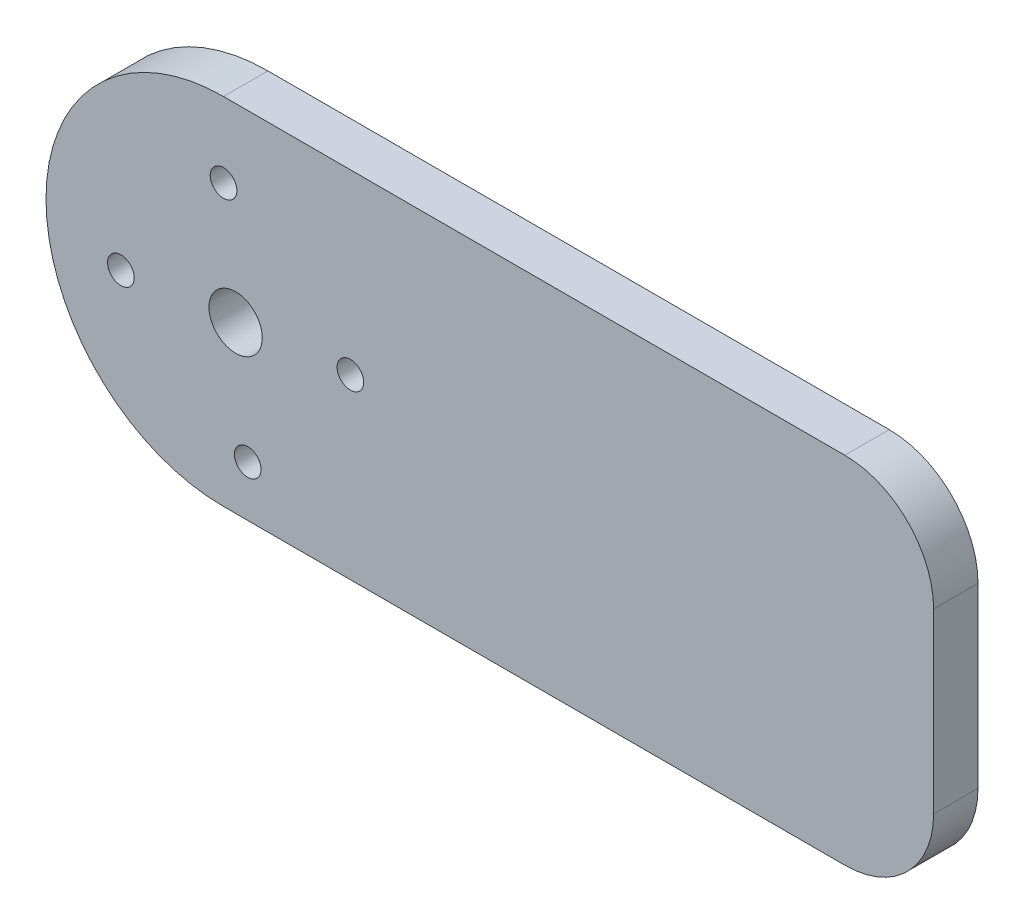
ISO-10303-21;
HEADER;
FILE_DESCRIPTION(('STEP AP214'),'2;1');
FILE_NAME('part.step','',(''),(''),'','','');
FILE_SCHEMA(('AUTOMOTIVE_DESIGN { 1 0 10303 214 1 1 1 1 }'));
ENDSEC;
DATA;
#1=APPLICATION_CONTEXT('core data for automotive mechanical design processes');
#2=APPLICATION_PROTOCOL_DEFINITION('international standard','automotive_design',2000,#1);
#3=PRODUCT_CONTEXT('',#1,'mechanical');
#4=PRODUCT('Part','Part','',(#3));
#5=PRODUCT_RELATED_PRODUCT_CATEGORY('part','',(#4));
#6=PRODUCT_DEFINITION_FORMATION('','',#4);
#7=PRODUCT_DEFINITION_CONTEXT('part definition',#1,'design');
#8=PRODUCT_DEFINITION('design','',#6,#7);
#9=PRODUCT_DEFINITION_SHAPE('','',#8);
#10=(LENGTH_UNIT() NAMED_UNIT(*) SI_UNIT(.MILLI.,.METRE.));
#11=(NAMED_UNIT(*) PLANE_ANGLE_UNIT() SI_UNIT($,.RADIAN.));
#12=(NAMED_UNIT(*) SI_UNIT($,.STERADIAN.) SOLID_ANGLE_UNIT());
#13=UNCERTAINTY_MEASURE_WITH_UNIT(LENGTH_MEASURE(1.E-05),#10,'distance_accuracy_value','');
#14=(GEOMETRIC_REPRESENTATION_CONTEXT(3) GLOBAL_UNCERTAINTY_ASSIGNED_CONTEXT((#13)) GLOBAL_UNIT_ASSIGNED_CONTEXT((#10,
#11,#12)) REPRESENTATION_CONTEXT('',''));
#15=CARTESIAN_POINT('',(0.,0.,0.));
#16=DIRECTION('',(0.,0.,1.));
#17=DIRECTION('',(1.,0.,0.));
#18=AXIS2_PLACEMENT_3D('',#15,#16,#17);
#19=CARTESIAN_POINT('',(0.,0.,5.));
#20=DIRECTION('',(0.,0.,1.));
#21=DIRECTION('',(1.,0.,0.));
#22=AXIS2_PLACEMENT_3D('',#19,#20,#21);
#23=PLANE('',#22);
#24=CARTESIAN_POINT('',(1.36380593722712,-1.36380593722729,5.));
#25=DIRECTION('',(0.,0.,1.));
#26=DIRECTION('',(1.,0.,0.));
#27=AXIS2_PLACEMENT_3D('',#24,#25,#26);
#28=CIRCLE('',#27,3.);
#29=CARTESIAN_POINT('',(4.36380593722713,-1.36380593722729,5.));
#30=VERTEX_POINT('',#29);
#31=EDGE_CURVE('E264',#30,#30,#28,.T.);
#32=ORIENTED_EDGE('',*,*,#31,.F.);
#33=EDGE_LOOP('',(#32));
#34=FACE_BOUND('',#33,.T.);
#35=CARTESIAN_POINT('',(2.72761187445429,-14.2920708388133,5.));
#36=DIRECTION('',(0.,0.,1.));
#37=DIRECTION('',(1.,0.,0.));
#38=AXIS2_PLACEMENT_3D('',#35,#36,#37);
#39=CIRCLE('',#38,1.5);
#40=CARTESIAN_POINT('',(4.22761187445429,-14.2920708388133,5.));
#41=VERTEX_POINT('',#40);
#42=EDGE_CURVE('E278',#41,#41,#39,.T.);
#43=ORIENTED_EDGE('',*,*,#42,.F.);
#44=EDGE_LOOP('',(#43));
#45=FACE_BOUND('',#44,.T.);
#46=CARTESIAN_POINT('',(0.,11.564458964359,5.));
#47=DIRECTION('',(0.,0.,1.));
#48=DIRECTION('',(1.,0.,0.));
#49=AXIS2_PLACEMENT_3D('',#46,#47,#48);
#50=CIRCLE('',#49,1.5);
#51=CARTESIAN_POINT('',(1.5,11.564458964359,5.));
#52=VERTEX_POINT('',#51);
#53=EDGE_CURVE('E138',#52,#52,#50,.T.);
#54=ORIENTED_EDGE('',*,*,#53,.F.);
#55=EDGE_LOOP('',(#54));
#56=FACE_BOUND('',#55,.T.);
#57=DIRECTION('',(1.,0.,0.));
#58=VECTOR('',#57,1.);
#59=CARTESIAN_POINT('',(0.,-20.,5.));
#60=LINE('',#59,#58);
#61=CARTESIAN_POINT('',(0.,-20.,5.));
#62=VERTEX_POINT('',#61);
#63=CARTESIAN_POINT('',(70.,-20.,5.));
#64=VERTEX_POINT('',#63);
#65=EDGE_CURVE('E85',#62,#64,#60,.T.);
#66=ORIENTED_EDGE('',*,*,#65,.T.);
#67=CARTESIAN_POINT('',(70.,-10.,5.));
#68=DIRECTION('',(0.,0.,1.));
#69=DIRECTION('',(1.,0.,0.));
#70=AXIS2_PLACEMENT_3D('',#67,#68,#69);
#71=CIRCLE('',#70,10.);
#72=CARTESIAN_POINT('',(80.,-10.,5.));
#73=VERTEX_POINT('',#72);
#74=EDGE_CURVE('E40',#64,#73,#71,.T.);
#75=ORIENTED_EDGE('',*,*,#74,.T.);
#76=DIRECTION('',(0.,1.,0.));
#77=VECTOR('',#76,1.);
#78=CARTESIAN_POINT('',(80.,20.,5.));
#79=LINE('',#78,#77);
#80=CARTESIAN_POINT('',(80.,10.,5.));
#81=VERTEX_POINT('',#80);
#82=EDGE_CURVE('E92',#73,#81,#79,.T.);
#83=ORIENTED_EDGE('',*,*,#82,.T.);
#84=CARTESIAN_POINT('',(70.,10.,5.));
#85=DIRECTION('',(0.,0.,1.));
#86=DIRECTION('',(1.,0.,0.));
#87=AXIS2_PLACEMENT_3D('',#84,#85,#86);
#88=CIRCLE('',#87,10.);
#89=CARTESIAN_POINT('',(70.,20.,5.));
#90=VERTEX_POINT('',#89);
#91=EDGE_CURVE('E47',#81,#90,#88,.T.);
#92=ORIENTED_EDGE('',*,*,#91,.T.);
#93=DIRECTION('',(-1.,0.,0.));
#94=VECTOR('',#93,1.);
#95=CARTESIAN_POINT('',(0.,20.,5.));
#96=LINE('',#95,#94);
#97=CARTESIAN_POINT('',(0.,20.,5.));
#98=VERTEX_POINT('',#97);
#99=EDGE_CURVE('E97',#90,#98,#96,.T.);
#100=ORIENTED_EDGE('',*,*,#99,.T.);
#101=CARTESIAN_POINT('',(0.,0.,5.));
#102=DIRECTION('',(0.,0.,1.));
#103=DIRECTION('',(1.,0.,0.));
#104=AXIS2_PLACEMENT_3D('',#101,#102,#103);
#105=CIRCLE('',#104,20.);
#106=EDGE_CURVE('E93',#98,#62,#105,.T.);
#107=ORIENTED_EDGE('',*,*,#106,.T.);
#108=EDGE_LOOP('',(#66,#75,#83,#92,#100,#107));
#109=FACE_BOUND('',#108,.T.);
#110=CARTESIAN_POINT('',(14.2920708388133,0.,5.));
#111=DIRECTION('',(0.,0.,1.));
#112=DIRECTION('',(1.,0.,0.));
#113=AXIS2_PLACEMENT_3D('',#110,#111,#112);
#114=CIRCLE('',#113,1.5);
#115=CARTESIAN_POINT('',(15.7920708388133,0.,5.));
#116=VERTEX_POINT('',#115);
#117=EDGE_CURVE('E284',#116,#116,#114,.T.);
#118=ORIENTED_EDGE('',*,*,#117,.F.);
#119=EDGE_LOOP('',(#118));
#120=FACE_BOUND('',#119,.T.);
#121=CARTESIAN_POINT('',(-11.564458964359,-2.72761187445428,5.));
#122=DIRECTION('',(0.,0.,1.));
#123=DIRECTION('',(1.,0.,0.));
#124=AXIS2_PLACEMENT_3D('',#121,#122,#123);
#125=CIRCLE('',#124,1.5);
#126=CARTESIAN_POINT('',(-10.064458964359,-2.72761187445428,5.));
#127=VERTEX_POINT('',#126);
#128=EDGE_CURVE('E272',#127,#127,#125,.T.);
#129=ORIENTED_EDGE('',*,*,#128,.F.);
#130=EDGE_LOOP('',(#129));
#131=FACE_BOUND('',#130,.T.);
#132=ADVANCED_FACE('F32',(#34,#45,#56,#109,#120,#131),#23,.T.);
#133=CARTESIAN_POINT('',(0.,0.,0.));
#134=DIRECTION('',(0.,0.,1.));
#135=DIRECTION('',(1.,0.,0.));
#136=AXIS2_PLACEMENT_3D('',#133,#134,#135);
#137=PLANE('',#136);
#138=CARTESIAN_POINT('',(1.36380593722712,-1.36380593722729,0.));
#139=DIRECTION('',(0.,0.,-1.));
#140=DIRECTION('',(-1.,0.,0.));
#141=AXIS2_PLACEMENT_3D('',#138,#139,#140);
#142=CIRCLE('',#141,3.);
#143=CARTESIAN_POINT('',(-1.63619406277288,-1.36380593722729,0.));
#144=VERTEX_POINT('',#143);
#145=EDGE_CURVE('E267',#144,#144,#142,.T.);
#146=ORIENTED_EDGE('',*,*,#145,.F.);
#147=EDGE_LOOP('',(#146));
#148=FACE_BOUND('',#147,.T.);
#149=DIRECTION('',(0.,1.,0.));
#150=VECTOR('',#149,1.);
#151=CARTESIAN_POINT('',(80.,20.,0.));
#152=LINE('',#151,#150);
#153=CARTESIAN_POINT('',(80.,-10.,0.));
#154=VERTEX_POINT('',#153);
#155=CARTESIAN_POINT('',(80.,10.,0.));
#156=VERTEX_POINT('',#155);
#157=EDGE_CURVE('E135',#154,#156,#152,.T.);
#158=ORIENTED_EDGE('',*,*,#157,.F.);
#159=CARTESIAN_POINT('',(70.,-10.,0.));
#160=DIRECTION('',(0.,0.,1.));
#161=DIRECTION('',(1.,0.,0.));
#162=AXIS2_PLACEMENT_3D('',#159,#160,#161);
#163=CIRCLE('',#162,10.);
#164=CARTESIAN_POINT('',(70.,-20.,0.));
#165=VERTEX_POINT('',#164);
#166=EDGE_CURVE('E118',#154,#165,#163,.F.);
#167=ORIENTED_EDGE('',*,*,#166,.T.);
#168=DIRECTION('',(1.,0.,0.));
#169=VECTOR('',#168,1.);
#170=CARTESIAN_POINT('',(0.,-20.,0.));
#171=LINE('',#170,#169);
#172=CARTESIAN_POINT('',(0.,-20.,0.));
#173=VERTEX_POINT('',#172);
#174=EDGE_CURVE('E134',#173,#165,#171,.T.);
#175=ORIENTED_EDGE('',*,*,#174,.F.);
#176=CARTESIAN_POINT('',(0.,0.,0.));
#177=DIRECTION('',(0.,0.,1.));
#178=DIRECTION('',(1.,0.,0.));
#179=AXIS2_PLACEMENT_3D('',#176,#177,#178);
#180=CIRCLE('',#179,20.);
#181=CARTESIAN_POINT('',(0.,20.,0.));
#182=VERTEX_POINT('',#181);
#183=EDGE_CURVE('E105',#182,#173,#180,.T.);
#184=ORIENTED_EDGE('',*,*,#183,.F.);
#185=DIRECTION('',(-1.,0.,0.));
#186=VECTOR('',#185,1.);
#187=CARTESIAN_POINT('',(0.,20.,0.));
#188=LINE('',#187,#186);
#189=CARTESIAN_POINT('',(70.,20.,0.));
#190=VERTEX_POINT('',#189);
#191=EDGE_CURVE('E101',#190,#182,#188,.T.);
#192=ORIENTED_EDGE('',*,*,#191,.F.);
#193=CARTESIAN_POINT('',(70.,10.,0.));
#194=DIRECTION('',(0.,0.,1.));
#195=DIRECTION('',(1.,0.,0.));
#196=AXIS2_PLACEMENT_3D('',#193,#194,#195);
#197=CIRCLE('',#196,10.);
#198=EDGE_CURVE('E116',#190,#156,#197,.F.);
#199=ORIENTED_EDGE('',*,*,#198,.T.);
#200=EDGE_LOOP('',(#158,#167,#175,#184,#192,#199));
#201=FACE_BOUND('',#200,.T.);
#202=CARTESIAN_POINT('',(0.,11.564458964359,0.));
#203=DIRECTION('',(0.,0.,1.));
#204=DIRECTION('',(1.,0.,0.));
#205=AXIS2_PLACEMENT_3D('',#202,#203,#204);
#206=CIRCLE('',#205,1.5);
#207=CARTESIAN_POINT('',(1.5,11.564458964359,0.));
#208=VERTEX_POINT('',#207);
#209=EDGE_CURVE('E287',#208,#208,#206,.T.);
#210=ORIENTED_EDGE('',*,*,#209,.T.);
#211=EDGE_LOOP('',(#210));
#212=FACE_BOUND('',#211,.T.);
#213=CARTESIAN_POINT('',(14.2920708388133,0.,0.));
#214=DIRECTION('',(0.,0.,1.));
#215=DIRECTION('',(1.,0.,0.));
#216=AXIS2_PLACEMENT_3D('',#213,#214,#215);
#217=CIRCLE('',#216,1.5);
#218=CARTESIAN_POINT('',(15.7920708388133,0.,0.));
#219=VERTEX_POINT('',#218);
#220=EDGE_CURVE('E281',#219,#219,#217,.T.);
#221=ORIENTED_EDGE('',*,*,#220,.T.);
#222=EDGE_LOOP('',(#221));
#223=FACE_BOUND('',#222,.T.);
#224=CARTESIAN_POINT('',(2.72761187445429,-14.2920708388133,0.));
#225=DIRECTION('',(0.,0.,1.));
#226=DIRECTION('',(1.,0.,0.));
#227=AXIS2_PLACEMENT_3D('',#224,#225,#226);
#228=CIRCLE('',#227,1.5);
#229=CARTESIAN_POINT('',(4.22761187445429,-14.2920708388133,0.));
#230=VERTEX_POINT('',#229);
#231=EDGE_CURVE('E275',#230,#230,#228,.T.);
#232=ORIENTED_EDGE('',*,*,#231,.T.);
#233=EDGE_LOOP('',(#232));
#234=FACE_BOUND('',#233,.T.);
#235=CARTESIAN_POINT('',(-11.564458964359,-2.72761187445428,0.));
#236=DIRECTION('',(0.,0.,1.));
#237=DIRECTION('',(1.,0.,0.));
#238=AXIS2_PLACEMENT_3D('',#235,#236,#237);
#239=CIRCLE('',#238,1.5);
#240=CARTESIAN_POINT('',(-10.064458964359,-2.72761187445428,0.));
#241=VERTEX_POINT('',#240);
#242=EDGE_CURVE('E269',#241,#241,#239,.T.);
#243=ORIENTED_EDGE('',*,*,#242,.T.);
#244=EDGE_LOOP('',(#243));
#245=FACE_BOUND('',#244,.T.);
#246=ADVANCED_FACE('F132',(#148,#201,#212,#223,#234,#245),#137,.F.);
#247=CARTESIAN_POINT('',(0.,0.,5.));
#248=DIRECTION('',(0.,0.,-1.));
#249=DIRECTION('',(-1.,0.,0.));
#250=AXIS2_PLACEMENT_3D('',#247,#248,#249);
#251=CYLINDRICAL_SURFACE('',#250,20.);
#252=ORIENTED_EDGE('',*,*,#183,.T.);
#253=DIRECTION('',(0.,0.,-1.));
#254=VECTOR('',#253,1.);
#255=CARTESIAN_POINT('',(0.,-20.,5.));
#256=LINE('',#255,#254);
#257=EDGE_CURVE('E89',#62,#173,#256,.T.);
#258=ORIENTED_EDGE('',*,*,#257,.F.);
#259=ORIENTED_EDGE('',*,*,#106,.F.);
#260=DIRECTION('',(0.,0.,-1.));
#261=VECTOR('',#260,1.);
#262=CARTESIAN_POINT('',(0.,20.,5.));
#263=LINE('',#262,#261);
#264=EDGE_CURVE('E107',#98,#182,#263,.T.);
#265=ORIENTED_EDGE('',*,*,#264,.T.);
#266=EDGE_LOOP('',(#252,#258,#259,#265));
#267=FACE_BOUND('',#266,.T.);
#268=ADVANCED_FACE('F103',(#267),#251,.T.);
#269=CARTESIAN_POINT('',(0.,-20.,5.));
#270=DIRECTION('',(0.,1.,0.));
#271=DIRECTION('',(0.,0.,1.));
#272=AXIS2_PLACEMENT_3D('',#269,#270,#271);
#273=PLANE('',#272);
#274=ORIENTED_EDGE('',*,*,#174,.T.);
#275=DIRECTION('',(0.,0.,-1.));
#276=VECTOR('',#275,1.);
#277=CARTESIAN_POINT('',(70.,-20.,5.));
#278=LINE('',#277,#276);
#279=EDGE_CURVE('E55',#165,#64,#278,.F.);
#280=ORIENTED_EDGE('',*,*,#279,.T.);
#281=ORIENTED_EDGE('',*,*,#65,.F.);
#282=ORIENTED_EDGE('',*,*,#257,.T.);
#283=EDGE_LOOP('',(#274,#280,#281,#282));
#284=FACE_BOUND('',#283,.T.);
#285=ADVANCED_FACE('F87',(#284),#273,.F.);
#286=CARTESIAN_POINT('',(80.,20.,5.));
#287=DIRECTION('',(-1.,0.,0.));
#288=DIRECTION('',(0.,0.,1.));
#289=AXIS2_PLACEMENT_3D('',#286,#287,#288);
#290=PLANE('',#289);
#291=ORIENTED_EDGE('',*,*,#82,.F.);
#292=DIRECTION('',(0.,0.,-1.));
#293=VECTOR('',#292,1.);
#294=CARTESIAN_POINT('',(80.,-10.,5.));
#295=LINE('',#294,#293);
#296=EDGE_CURVE('E109',#73,#154,#295,.T.);
#297=ORIENTED_EDGE('',*,*,#296,.T.);
#298=ORIENTED_EDGE('',*,*,#157,.T.);
#299=DIRECTION('',(0.,0.,-1.));
#300=VECTOR('',#299,1.);
#301=CARTESIAN_POINT('',(80.,10.,5.));
#302=LINE('',#301,#300);
#303=EDGE_CURVE('E106',#156,#81,#302,.F.);
#304=ORIENTED_EDGE('',*,*,#303,.T.);
#305=EDGE_LOOP('',(#291,#297,#298,#304));
#306=FACE_BOUND('',#305,.T.);
#307=ADVANCED_FACE('F125',(#306),#290,.F.);
#308=CARTESIAN_POINT('',(0.,20.,5.));
#309=DIRECTION('',(0.,-1.,0.));
#310=DIRECTION('',(0.,0.,-1.));
#311=AXIS2_PLACEMENT_3D('',#308,#309,#310);
#312=PLANE('',#311);
#313=ORIENTED_EDGE('',*,*,#99,.F.);
#314=DIRECTION('',(0.,0.,-1.));
#315=VECTOR('',#314,1.);
#316=CARTESIAN_POINT('',(70.,20.,5.));
#317=LINE('',#316,#315);
#318=EDGE_CURVE('E11',#90,#190,#317,.T.);
#319=ORIENTED_EDGE('',*,*,#318,.T.);
#320=ORIENTED_EDGE('',*,*,#191,.T.);
#321=ORIENTED_EDGE('',*,*,#264,.F.);
#322=EDGE_LOOP('',(#313,#319,#320,#321));
#323=FACE_BOUND('',#322,.T.);
#324=ADVANCED_FACE('F143',(#323),#312,.F.);
#325=CARTESIAN_POINT('',(0.,11.564458964359,5.));
#326=DIRECTION('',(0.,0.,-1.));
#327=DIRECTION('',(-1.,0.,0.));
#328=AXIS2_PLACEMENT_3D('',#325,#326,#327);
#329=CYLINDRICAL_SURFACE('',#328,1.5);
#330=ORIENTED_EDGE('',*,*,#53,.T.);
#331=EDGE_LOOP('',(#330));
#332=FACE_BOUND('',#331,.T.);
#333=ORIENTED_EDGE('',*,*,#209,.F.);
#334=EDGE_LOOP('',(#333));
#335=FACE_BOUND('',#334,.T.);
#336=ADVANCED_FACE('F162',(#332,#335),#329,.F.);
#337=CARTESIAN_POINT('',(14.2920708388133,0.,5.));
#338=DIRECTION('',(0.,0.,-1.));
#339=DIRECTION('',(-1.,0.,0.));
#340=AXIS2_PLACEMENT_3D('',#337,#338,#339);
#341=CYLINDRICAL_SURFACE('',#340,1.5);
#342=ORIENTED_EDGE('',*,*,#117,.T.);
#343=EDGE_LOOP('',(#342));
#344=FACE_BOUND('',#343,.T.);
#345=ORIENTED_EDGE('',*,*,#220,.F.);
#346=EDGE_LOOP('',(#345));
#347=FACE_BOUND('',#346,.T.);
#348=ADVANCED_FACE('F195',(#344,#347),#341,.F.);
#349=CARTESIAN_POINT('',(2.72761187445429,-14.2920708388133,5.));
#350=DIRECTION('',(0.,0.,-1.));
#351=DIRECTION('',(-1.,0.,0.));
#352=AXIS2_PLACEMENT_3D('',#349,#350,#351);
#353=CYLINDRICAL_SURFACE('',#352,1.5);
#354=ORIENTED_EDGE('',*,*,#42,.T.);
#355=EDGE_LOOP('',(#354));
#356=FACE_BOUND('',#355,.T.);
#357=ORIENTED_EDGE('',*,*,#231,.F.);
#358=EDGE_LOOP('',(#357));
#359=FACE_BOUND('',#358,.T.);
#360=ADVANCED_FACE('F202',(#356,#359),#353,.F.);
#361=CARTESIAN_POINT('',(-11.564458964359,-2.72761187445428,5.));
#362=DIRECTION('',(0.,0.,-1.));
#363=DIRECTION('',(-1.,0.,0.));
#364=AXIS2_PLACEMENT_3D('',#361,#362,#363);
#365=CYLINDRICAL_SURFACE('',#364,1.5);
#366=ORIENTED_EDGE('',*,*,#128,.T.);
#367=EDGE_LOOP('',(#366));
#368=FACE_BOUND('',#367,.T.);
#369=ORIENTED_EDGE('',*,*,#242,.F.);
#370=EDGE_LOOP('',(#369));
#371=FACE_BOUND('',#370,.T.);
#372=ADVANCED_FACE('F209',(#368,#371),#365,.F.);
#373=CARTESIAN_POINT('',(1.36380593722712,-1.36380593722729,10.));
#374=DIRECTION('',(0.,0.,-1.));
#375=DIRECTION('',(-1.,0.,0.));
#376=AXIS2_PLACEMENT_3D('',#373,#374,#375);
#377=CYLINDRICAL_SURFACE('',#376,3.);
#378=ORIENTED_EDGE('',*,*,#31,.T.);
#379=EDGE_LOOP('',(#378));
#380=FACE_BOUND('',#379,.T.);
#381=ORIENTED_EDGE('',*,*,#145,.T.);
#382=EDGE_LOOP('',(#381));
#383=FACE_BOUND('',#382,.T.);
#384=ADVANCED_FACE('F150',(#380,#383),#377,.F.);
#385=CARTESIAN_POINT('',(70.,-10.,5.));
#386=DIRECTION('',(0.,0.,-1.));
#387=DIRECTION('',(-1.,0.,0.));
#388=AXIS2_PLACEMENT_3D('',#385,#386,#387);
#389=CYLINDRICAL_SURFACE('',#388,10.);
#390=ORIENTED_EDGE('',*,*,#74,.F.);
#391=ORIENTED_EDGE('',*,*,#279,.F.);
#392=ORIENTED_EDGE('',*,*,#166,.F.);
#393=ORIENTED_EDGE('',*,*,#296,.F.);
#394=EDGE_LOOP('',(#390,#391,#392,#393));
#395=FACE_BOUND('',#394,.T.);
#396=ADVANCED_FACE('F130',(#395),#389,.T.);
#397=CARTESIAN_POINT('',(70.,10.,5.));
#398=DIRECTION('',(0.,0.,-1.));
#399=DIRECTION('',(-1.,0.,0.));
#400=AXIS2_PLACEMENT_3D('',#397,#398,#399);
#401=CYLINDRICAL_SURFACE('',#400,10.);
#402=ORIENTED_EDGE('',*,*,#91,.F.);
#403=ORIENTED_EDGE('',*,*,#303,.F.);
#404=ORIENTED_EDGE('',*,*,#198,.F.);
#405=ORIENTED_EDGE('',*,*,#318,.F.);
#406=EDGE_LOOP('',(#402,#403,#404,#405));
#407=FACE_BOUND('',#406,.T.);
#408=ADVANCED_FACE('F34',(#407),#401,.T.);
#409=CLOSED_SHELL('',(#132,#246,#268,#285,#307,#324,#336,#348,#360,#372,#384,#396,#408));
#410=MANIFOLD_SOLID_BREP('B2',#409);
#411=ADVANCED_BREP_SHAPE_REPRESENTATION('',(#18,#410),#14);
#412=SHAPE_DEFINITION_REPRESENTATION(#9,#411);
ENDSEC;
END-ISO-10303-21;
